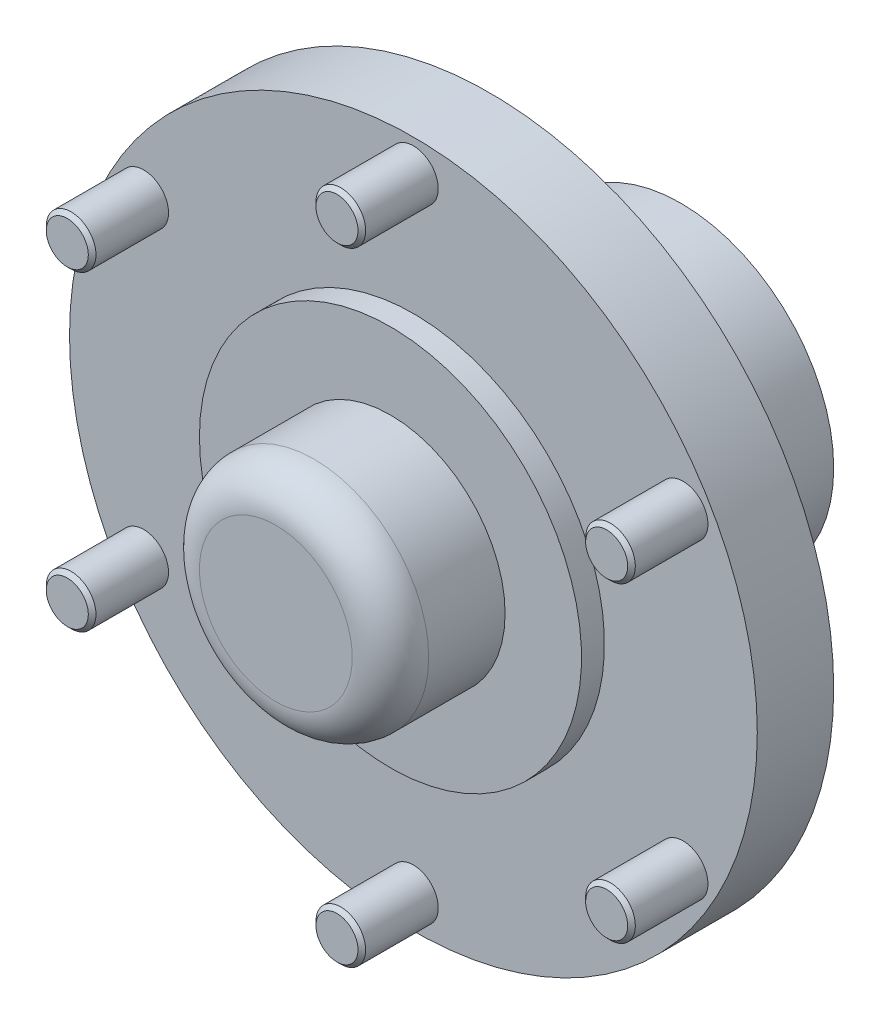
ISO-10303-21;
HEADER;
FILE_DESCRIPTION(('STEP AP214'),'2;1');
FILE_NAME('part.step','',(''),(''),'','','');
FILE_SCHEMA(('AUTOMOTIVE_DESIGN { 1 0 10303 214 1 1 1 1 }'));
ENDSEC;
DATA;
#1=APPLICATION_CONTEXT('core data for automotive mechanical design processes');
#2=APPLICATION_PROTOCOL_DEFINITION('international standard','automotive_design',2000,#1);
#3=PRODUCT_CONTEXT('',#1,'mechanical');
#4=PRODUCT('Part','Part','',(#3));
#5=PRODUCT_RELATED_PRODUCT_CATEGORY('part','',(#4));
#6=PRODUCT_DEFINITION_FORMATION('','',#4);
#7=PRODUCT_DEFINITION_CONTEXT('part definition',#1,'design');
#8=PRODUCT_DEFINITION('design','',#6,#7);
#9=PRODUCT_DEFINITION_SHAPE('','',#8);
#10=(LENGTH_UNIT() NAMED_UNIT(*) SI_UNIT(.MILLI.,.METRE.));
#11=(NAMED_UNIT(*) PLANE_ANGLE_UNIT() SI_UNIT($,.RADIAN.));
#12=(NAMED_UNIT(*) SI_UNIT($,.STERADIAN.) SOLID_ANGLE_UNIT());
#13=UNCERTAINTY_MEASURE_WITH_UNIT(LENGTH_MEASURE(1.E-05),#10,'distance_accuracy_value','');
#14=(GEOMETRIC_REPRESENTATION_CONTEXT(3) GLOBAL_UNCERTAINTY_ASSIGNED_CONTEXT((#13)) GLOBAL_UNIT_ASSIGNED_CONTEXT((#10,
#11,#12)) REPRESENTATION_CONTEXT('',''));
#15=CARTESIAN_POINT('',(0.,0.,0.));
#16=DIRECTION('',(0.,0.,1.));
#17=DIRECTION('',(1.,0.,0.));
#18=AXIS2_PLACEMENT_3D('',#15,#16,#17);
#19=CARTESIAN_POINT('',(90.0000000000001,1.86517468137026E-11,-36.0000000000014));
#20=DIRECTION('',(0.,0.,1.));
#21=DIRECTION('',(1.,0.,0.));
#22=AXIS2_PLACEMENT_3D('',#19,#20,#21);
#23=PLANE('',#22);
#24=CARTESIAN_POINT('',(70.5810704084321,40.7499999999993,-36.0000000000014));
#25=DIRECTION('',(0.,0.,1.));
#26=DIRECTION('',(0.,-1.,0.));
#27=AXIS2_PLACEMENT_3D('',#24,#25,#26);
#28=CIRCLE('',#27,6.5);
#29=CARTESIAN_POINT('',(70.5810704084321,34.2499999999993,-36.0000000000014));
#30=VERTEX_POINT('',#29);
#31=EDGE_CURVE('E126',#30,#30,#28,.T.);
#32=ORIENTED_EDGE('',*,*,#31,.F.);
#33=EDGE_LOOP('',(#32));
#34=FACE_BOUND('',#33,.T.);
#35=CARTESIAN_POINT('',(-70.5810704084316,40.7500000000003,-36.0000000000014));
#36=DIRECTION('',(0.,0.,1.));
#37=DIRECTION('',(0.,-1.,0.));
#38=AXIS2_PLACEMENT_3D('',#35,#36,#37);
#39=CIRCLE('',#38,6.5);
#40=CARTESIAN_POINT('',(-70.5810704084316,34.2500000000003,-36.0000000000014));
#41=VERTEX_POINT('',#40);
#42=EDGE_CURVE('E120',#41,#41,#39,.T.);
#43=ORIENTED_EDGE('',*,*,#42,.F.);
#44=EDGE_LOOP('',(#43));
#45=FACE_BOUND('',#44,.T.);
#46=CARTESIAN_POINT('',(-70.5810704084319,-40.7499999999998,-36.0000000000014));
#47=DIRECTION('',(0.,0.,1.));
#48=DIRECTION('',(0.,-1.,0.));
#49=AXIS2_PLACEMENT_3D('',#46,#47,#48);
#50=CIRCLE('',#49,6.5);
#51=CARTESIAN_POINT('',(-70.5810704084319,-47.2499999999999,-36.0000000000014));
#52=VERTEX_POINT('',#51);
#53=EDGE_CURVE('E114',#52,#52,#50,.T.);
#54=ORIENTED_EDGE('',*,*,#53,.F.);
#55=EDGE_LOOP('',(#54));
#56=FACE_BOUND('',#55,.T.);
#57=CARTESIAN_POINT('',(0.,1.86517468137026E-11,-36.0000000000014));
#58=DIRECTION('',(0.,0.,-1.));
#59=DIRECTION('',(-1.,0.,0.));
#60=AXIS2_PLACEMENT_3D('',#57,#58,#59);
#61=CIRCLE('',#60,50.);
#62=CARTESIAN_POINT('',(-50.,1.86517468137026E-11,-36.0000000000014));
#63=VERTEX_POINT('',#62);
#64=EDGE_CURVE('E105',#63,#63,#61,.T.);
#65=ORIENTED_EDGE('',*,*,#64,.T.);
#66=EDGE_LOOP('',(#65));
#67=FACE_BOUND('',#66,.T.);
#68=CARTESIAN_POINT('',(0.,1.86517468137026E-11,-36.0000000000014));
#69=DIRECTION('',(0.,0.,-1.));
#70=DIRECTION('',(-1.,0.,0.));
#71=AXIS2_PLACEMENT_3D('',#68,#69,#70);
#72=CIRCLE('',#71,90.0000000000001);
#73=CARTESIAN_POINT('',(-90.0000000000001,1.86517468137026E-11,-36.0000000000014));
#74=VERTEX_POINT('',#73);
#75=EDGE_CURVE('E102',#74,#74,#72,.T.);
#76=ORIENTED_EDGE('',*,*,#75,.F.);
#77=EDGE_LOOP('',(#76));
#78=FACE_BOUND('',#77,.T.);
#79=CARTESIAN_POINT('',(0.,-81.5,-36.0000000000014));
#80=DIRECTION('',(0.,0.,1.));
#81=DIRECTION('',(0.,-1.,0.));
#82=AXIS2_PLACEMENT_3D('',#79,#80,#81);
#83=CIRCLE('',#82,6.5);
#84=CARTESIAN_POINT('',(0.,-88.,-36.0000000000014));
#85=VERTEX_POINT('',#84);
#86=EDGE_CURVE('E117',#85,#85,#83,.T.);
#87=ORIENTED_EDGE('',*,*,#86,.F.);
#88=EDGE_LOOP('',(#87));
#89=FACE_BOUND('',#88,.T.);
#90=CARTESIAN_POINT('',(5.6770344404181E-13,81.5,-36.0000000000014));
#91=DIRECTION('',(0.,0.,1.));
#92=DIRECTION('',(0.,-1.,0.));
#93=AXIS2_PLACEMENT_3D('',#90,#91,#92);
#94=CIRCLE('',#93,6.5);
#95=CARTESIAN_POINT('',(5.6770344404181E-13,75.,-36.0000000000014));
#96=VERTEX_POINT('',#95);
#97=EDGE_CURVE('E123',#96,#96,#94,.T.);
#98=ORIENTED_EDGE('',*,*,#97,.F.);
#99=EDGE_LOOP('',(#98));
#100=FACE_BOUND('',#99,.T.);
#101=CARTESIAN_POINT('',(70.5810704084313,-40.7500000000008,-36.0000000000014));
#102=DIRECTION('',(0.,0.,1.));
#103=DIRECTION('',(0.,-1.,0.));
#104=AXIS2_PLACEMENT_3D('',#101,#102,#103);
#105=CIRCLE('',#104,6.5);
#106=CARTESIAN_POINT('',(70.5810704084313,-47.2500000000008,-36.0000000000014));
#107=VERTEX_POINT('',#106);
#108=EDGE_CURVE('E129',#107,#107,#105,.T.);
#109=ORIENTED_EDGE('',*,*,#108,.F.);
#110=EDGE_LOOP('',(#109));
#111=FACE_BOUND('',#110,.T.);
#112=ADVANCED_FACE('F34',(#34,#45,#56,#67,#78,#89,#100,#111),#23,.T.);
#113=CARTESIAN_POINT('',(0.,1.86517468137026E-11,0.));
#114=DIRECTION('',(0.,0.,-1.));
#115=DIRECTION('',(-1.,0.,0.));
#116=AXIS2_PLACEMENT_3D('',#113,#114,#115);
#117=CYLINDRICAL_SURFACE('',#116,30.);
#118=CARTESIAN_POINT('',(0.,1.86517468137026E-11,-10.));
#119=DIRECTION('',(0.,0.,1.));
#120=DIRECTION('',(1.,0.,0.));
#121=AXIS2_PLACEMENT_3D('',#118,#119,#120);
#122=CIRCLE('',#121,30.);
#123=CARTESIAN_POINT('',(30.,1.86517468137026E-11,-10.));
#124=VERTEX_POINT('',#123);
#125=EDGE_CURVE('E87',#124,#124,#122,.F.);
#126=ORIENTED_EDGE('',*,*,#125,.T.);
#127=EDGE_LOOP('',(#126));
#128=FACE_BOUND('',#127,.T.);
#129=CARTESIAN_POINT('',(0.,1.86517468137026E-11,-29.9999999999727));
#130=DIRECTION('',(0.,0.,-1.));
#131=DIRECTION('',(-1.,0.,0.));
#132=AXIS2_PLACEMENT_3D('',#129,#130,#131);
#133=CIRCLE('',#132,30.);
#134=CARTESIAN_POINT('',(-30.,1.86517468137026E-11,-29.9999999999727));
#135=VERTEX_POINT('',#134);
#136=EDGE_CURVE('E111',#135,#135,#133,.T.);
#137=ORIENTED_EDGE('',*,*,#136,.F.);
#138=EDGE_LOOP('',(#137));
#139=FACE_BOUND('',#138,.T.);
#140=ADVANCED_FACE('F136',(#128,#139),#117,.T.);
#141=CARTESIAN_POINT('',(30.,1.86517468137026E-11,0.));
#142=DIRECTION('',(0.,0.,1.));
#143=DIRECTION('',(1.,0.,0.));
#144=AXIS2_PLACEMENT_3D('',#141,#142,#143);
#145=PLANE('',#144);
#146=CARTESIAN_POINT('',(0.,1.86517468137026E-11,0.));
#147=DIRECTION('',(0.,0.,1.));
#148=DIRECTION('',(1.,0.,0.));
#149=AXIS2_PLACEMENT_3D('',#146,#147,#148);
#150=CIRCLE('',#149,20.);
#151=CARTESIAN_POINT('',(20.,1.86517468137026E-11,0.));
#152=VERTEX_POINT('',#151);
#153=EDGE_CURVE('E84',#152,#152,#150,.T.);
#154=ORIENTED_EDGE('',*,*,#153,.T.);
#155=EDGE_LOOP('',(#154));
#156=FACE_BOUND('',#155,.T.);
#157=ADVANCED_FACE('F142',(#156),#145,.T.);
#158=CARTESIAN_POINT('',(0.,1.86517468137026E-11,-76.0000000000218));
#159=DIRECTION('',(0.,0.,-1.));
#160=DIRECTION('',(-1.,0.,0.));
#161=AXIS2_PLACEMENT_3D('',#158,#159,#160);
#162=PLANE('',#161);
#163=CARTESIAN_POINT('',(0.,1.86517468137026E-11,-76.0000000000218));
#164=DIRECTION('',(0.,0.,-1.));
#165=DIRECTION('',(-1.,0.,0.));
#166=AXIS2_PLACEMENT_3D('',#163,#164,#165);
#167=CIRCLE('',#166,30.);
#168=CARTESIAN_POINT('',(-30.,1.86517468137026E-11,-76.0000000000218));
#169=VERTEX_POINT('',#168);
#170=EDGE_CURVE('E90',#169,#169,#167,.T.);
#171=ORIENTED_EDGE('',*,*,#170,.T.);
#172=EDGE_LOOP('',(#171));
#173=FACE_BOUND('',#172,.T.);
#174=ADVANCED_FACE('F170',(#173),#162,.T.);
#175=CARTESIAN_POINT('',(0.,1.86517468137026E-11,0.));
#176=DIRECTION('',(0.,0.,-1.));
#177=DIRECTION('',(-1.,0.,0.));
#178=AXIS2_PLACEMENT_3D('',#175,#176,#177);
#179=CYLINDRICAL_SURFACE('',#178,30.);
#180=CARTESIAN_POINT('',(0.,1.86517468137026E-11,-105.999999999995));
#181=DIRECTION('',(0.,0.,-1.));
#182=DIRECTION('',(-1.,0.,0.));
#183=AXIS2_PLACEMENT_3D('',#180,#181,#182);
#184=CIRCLE('',#183,30.);
#185=CARTESIAN_POINT('',(-30.,1.86517468137026E-11,-105.999999999995));
#186=VERTEX_POINT('',#185);
#187=EDGE_CURVE('E93',#186,#186,#184,.T.);
#188=ORIENTED_EDGE('',*,*,#187,.T.);
#189=EDGE_LOOP('',(#188));
#190=FACE_BOUND('',#189,.T.);
#191=ORIENTED_EDGE('',*,*,#170,.F.);
#192=EDGE_LOOP('',(#191));
#193=FACE_BOUND('',#192,.T.);
#194=ADVANCED_FACE('F166',(#190,#193),#179,.F.);
#195=CARTESIAN_POINT('',(30.,1.86517468137026E-11,-105.999999999995));
#196=DIRECTION('',(0.,0.,-1.));
#197=DIRECTION('',(-1.,0.,0.));
#198=AXIS2_PLACEMENT_3D('',#195,#196,#197);
#199=PLANE('',#198);
#200=CARTESIAN_POINT('',(0.,1.86517468137026E-11,-105.999999999995));
#201=DIRECTION('',(0.,0.,-1.));
#202=DIRECTION('',(-1.,0.,0.));
#203=AXIS2_PLACEMENT_3D('',#200,#201,#202);
#204=CIRCLE('',#203,40.);
#205=CARTESIAN_POINT('',(-40.,1.86517468137026E-11,-105.999999999995));
#206=VERTEX_POINT('',#205);
#207=EDGE_CURVE('E96',#206,#206,#204,.T.);
#208=ORIENTED_EDGE('',*,*,#207,.T.);
#209=EDGE_LOOP('',(#208));
#210=FACE_BOUND('',#209,.T.);
#211=ORIENTED_EDGE('',*,*,#187,.F.);
#212=EDGE_LOOP('',(#211));
#213=FACE_BOUND('',#212,.T.);
#214=ADVANCED_FACE('F162',(#210,#213),#199,.T.);
#215=CARTESIAN_POINT('',(0.,1.86517468137026E-11,0.));
#216=DIRECTION('',(0.,0.,-1.));
#217=DIRECTION('',(-1.,0.,0.));
#218=AXIS2_PLACEMENT_3D('',#215,#216,#217);
#219=CYLINDRICAL_SURFACE('',#218,40.);
#220=CARTESIAN_POINT('',(0.,1.86517468137026E-11,-80.9999999999832));
#221=DIRECTION('',(0.,0.,-1.));
#222=DIRECTION('',(-1.,0.,0.));
#223=AXIS2_PLACEMENT_3D('',#220,#221,#222);
#224=CIRCLE('',#223,40.);
#225=CARTESIAN_POINT('',(-40.,1.86517468137026E-11,-80.9999999999832));
#226=VERTEX_POINT('',#225);
#227=EDGE_CURVE('E81',#226,#226,#224,.T.);
#228=ORIENTED_EDGE('',*,*,#227,.T.);
#229=EDGE_LOOP('',(#228));
#230=FACE_BOUND('',#229,.T.);
#231=ORIENTED_EDGE('',*,*,#207,.F.);
#232=EDGE_LOOP('',(#231));
#233=FACE_BOUND('',#232,.T.);
#234=ADVANCED_FACE('F158',(#230,#233),#219,.T.);
#235=CARTESIAN_POINT('',(40.,1.86517468137026E-11,-55.9999999999832));
#236=DIRECTION('',(0.,0.,-1.));
#237=DIRECTION('',(-1.,0.,0.));
#238=AXIS2_PLACEMENT_3D('',#235,#236,#237);
#239=PLANE('',#238);
#240=CARTESIAN_POINT('',(0.,1.86517468137026E-11,-55.9999999999832));
#241=DIRECTION('',(0.,0.,-1.));
#242=DIRECTION('',(-1.,0.,0.));
#243=AXIS2_PLACEMENT_3D('',#240,#241,#242);
#244=CIRCLE('',#243,65.);
#245=CARTESIAN_POINT('',(-65.,1.86517468137026E-11,-55.9999999999832));
#246=VERTEX_POINT('',#245);
#247=EDGE_CURVE('E78',#246,#246,#244,.F.);
#248=ORIENTED_EDGE('',*,*,#247,.T.);
#249=EDGE_LOOP('',(#248));
#250=FACE_BOUND('',#249,.T.);
#251=CARTESIAN_POINT('',(0.,1.86517468137026E-11,-55.9999999999832));
#252=DIRECTION('',(0.,0.,-1.));
#253=DIRECTION('',(-1.,0.,0.));
#254=AXIS2_PLACEMENT_3D('',#251,#252,#253);
#255=CIRCLE('',#254,90.0000000000001);
#256=CARTESIAN_POINT('',(-90.0000000000001,1.86517468137026E-11,-55.9999999999832));
#257=VERTEX_POINT('',#256);
#258=EDGE_CURVE('E99',#257,#257,#255,.T.);
#259=ORIENTED_EDGE('',*,*,#258,.T.);
#260=EDGE_LOOP('',(#259));
#261=FACE_BOUND('',#260,.T.);
#262=ADVANCED_FACE('F154',(#250,#261),#239,.T.);
#263=CARTESIAN_POINT('',(0.,1.86517468137026E-11,0.));
#264=DIRECTION('',(0.,0.,-1.));
#265=DIRECTION('',(-1.,0.,0.));
#266=AXIS2_PLACEMENT_3D('',#263,#264,#265);
#267=CYLINDRICAL_SURFACE('',#266,90.0000000000001);
#268=ORIENTED_EDGE('',*,*,#75,.T.);
#269=EDGE_LOOP('',(#268));
#270=FACE_BOUND('',#269,.T.);
#271=ORIENTED_EDGE('',*,*,#258,.F.);
#272=EDGE_LOOP('',(#271));
#273=FACE_BOUND('',#272,.T.);
#274=ADVANCED_FACE('F151',(#270,#273),#267,.T.);
#275=CARTESIAN_POINT('',(0.,1.86517468137026E-11,0.));
#276=DIRECTION('',(0.,0.,-1.));
#277=DIRECTION('',(-1.,0.,0.));
#278=AXIS2_PLACEMENT_3D('',#275,#276,#277);
#279=CYLINDRICAL_SURFACE('',#278,50.);
#280=CARTESIAN_POINT('',(0.,1.86517468137026E-11,-29.9999999999727));
#281=DIRECTION('',(0.,0.,-1.));
#282=DIRECTION('',(-1.,0.,0.));
#283=AXIS2_PLACEMENT_3D('',#280,#281,#282);
#284=CIRCLE('',#283,50.);
#285=CARTESIAN_POINT('',(-50.,1.86517468137026E-11,-29.9999999999727));
#286=VERTEX_POINT('',#285);
#287=EDGE_CURVE('E108',#286,#286,#284,.T.);
#288=ORIENTED_EDGE('',*,*,#287,.T.);
#289=EDGE_LOOP('',(#288));
#290=FACE_BOUND('',#289,.T.);
#291=ORIENTED_EDGE('',*,*,#64,.F.);
#292=EDGE_LOOP('',(#291));
#293=FACE_BOUND('',#292,.T.);
#294=ADVANCED_FACE('F149',(#290,#293),#279,.T.);
#295=CARTESIAN_POINT('',(50.,1.86517468137026E-11,-29.9999999999727));
#296=DIRECTION('',(0.,0.,1.));
#297=DIRECTION('',(1.,0.,0.));
#298=AXIS2_PLACEMENT_3D('',#295,#296,#297);
#299=PLANE('',#298);
#300=ORIENTED_EDGE('',*,*,#136,.T.);
#301=EDGE_LOOP('',(#300));
#302=FACE_BOUND('',#301,.T.);
#303=ORIENTED_EDGE('',*,*,#287,.F.);
#304=EDGE_LOOP('',(#303));
#305=FACE_BOUND('',#304,.T.);
#306=ADVANCED_FACE('F242',(#302,#305),#299,.T.);
#307=CARTESIAN_POINT('',(-70.5810704084319,-40.7499999999998,-16.0000000000014));
#308=DIRECTION('',(0.,0.,-1.));
#309=DIRECTION('',(0.,1.,0.));
#310=AXIS2_PLACEMENT_3D('',#307,#308,#309);
#311=CYLINDRICAL_SURFACE('',#310,6.5);
#312=CARTESIAN_POINT('',(-70.5810704084319,-40.7499999999998,-17.0000000000014));
#313=DIRECTION('',(0.,0.,1.));
#314=DIRECTION('',(1.,0.,0.));
#315=AXIS2_PLACEMENT_3D('',#312,#313,#314);
#316=CIRCLE('',#315,6.5);
#317=CARTESIAN_POINT('',(-64.0810704084318,-40.7499999999998,-17.0000000000014));
#318=VERTEX_POINT('',#317);
#319=EDGE_CURVE('E11',#318,#318,#316,.F.);
#320=ORIENTED_EDGE('',*,*,#319,.T.);
#321=EDGE_LOOP('',(#320));
#322=FACE_BOUND('',#321,.T.);
#323=ORIENTED_EDGE('',*,*,#53,.T.);
#324=EDGE_LOOP('',(#323));
#325=FACE_BOUND('',#324,.T.);
#326=ADVANCED_FACE('F240',(#322,#325),#311,.T.);
#327=CARTESIAN_POINT('',(-70.5810704084319,-40.7499999999998,-16.0000000000014));
#328=DIRECTION('',(0.,0.,1.));
#329=DIRECTION('',(0.,-1.,0.));
#330=AXIS2_PLACEMENT_3D('',#327,#328,#329);
#331=PLANE('',#330);
#332=CARTESIAN_POINT('',(-70.5810704084319,-40.7499999999998,-16.0000000000014));
#333=DIRECTION('',(0.,0.,1.));
#334=DIRECTION('',(0.,-1.,0.));
#335=AXIS2_PLACEMENT_3D('',#332,#333,#334);
#336=CIRCLE('',#335,5.49999999999998);
#337=CARTESIAN_POINT('',(-70.5810704084319,-46.2499999999998,-16.0000000000014));
#338=VERTEX_POINT('',#337);
#339=EDGE_CURVE('E41',#338,#338,#336,.T.);
#340=ORIENTED_EDGE('',*,*,#339,.T.);
#341=EDGE_LOOP('',(#340));
#342=FACE_BOUND('',#341,.T.);
#343=ADVANCED_FACE('F236',(#342),#331,.T.);
#344=CARTESIAN_POINT('',(0.,-81.5,-16.0000000000014));
#345=DIRECTION('',(0.,0.,-1.));
#346=DIRECTION('',(0.,1.,0.));
#347=AXIS2_PLACEMENT_3D('',#344,#345,#346);
#348=CYLINDRICAL_SURFACE('',#347,6.5);
#349=CARTESIAN_POINT('',(0.,-81.5,-17.0000000000014));
#350=DIRECTION('',(0.,0.,1.));
#351=DIRECTION('',(1.,0.,0.));
#352=AXIS2_PLACEMENT_3D('',#349,#350,#351);
#353=CIRCLE('',#352,6.5);
#354=CARTESIAN_POINT('',(6.5,-81.5,-17.0000000000014));
#355=VERTEX_POINT('',#354);
#356=EDGE_CURVE('E60',#355,#355,#353,.F.);
#357=ORIENTED_EDGE('',*,*,#356,.T.);
#358=EDGE_LOOP('',(#357));
#359=FACE_BOUND('',#358,.T.);
#360=ORIENTED_EDGE('',*,*,#86,.T.);
#361=EDGE_LOOP('',(#360));
#362=FACE_BOUND('',#361,.T.);
#363=ADVANCED_FACE('F232',(#359,#362),#348,.T.);
#364=CARTESIAN_POINT('',(0.,-81.5,-16.0000000000014));
#365=DIRECTION('',(0.,0.,1.));
#366=DIRECTION('',(0.,-1.,0.));
#367=AXIS2_PLACEMENT_3D('',#364,#365,#366);
#368=PLANE('',#367);
#369=CARTESIAN_POINT('',(0.,-81.5,-16.0000000000014));
#370=DIRECTION('',(0.,0.,1.));
#371=DIRECTION('',(0.,-1.,0.));
#372=AXIS2_PLACEMENT_3D('',#369,#370,#371);
#373=CIRCLE('',#372,5.50000000000001);
#374=CARTESIAN_POINT('',(0.,-87.,-16.0000000000014));
#375=VERTEX_POINT('',#374);
#376=EDGE_CURVE('E63',#375,#375,#373,.T.);
#377=ORIENTED_EDGE('',*,*,#376,.T.);
#378=EDGE_LOOP('',(#377));
#379=FACE_BOUND('',#378,.T.);
#380=ADVANCED_FACE('F225',(#379),#368,.T.);
#381=CARTESIAN_POINT('',(-70.5810704084316,40.7500000000003,-16.0000000000014));
#382=DIRECTION('',(0.,0.,-1.));
#383=DIRECTION('',(0.,1.,0.));
#384=AXIS2_PLACEMENT_3D('',#381,#382,#383);
#385=CYLINDRICAL_SURFACE('',#384,6.5);
#386=CARTESIAN_POINT('',(-70.5810704084316,40.7500000000003,-17.0000000000013));
#387=DIRECTION('',(0.,0.,1.));
#388=DIRECTION('',(1.,0.,0.));
#389=AXIS2_PLACEMENT_3D('',#386,#387,#388);
#390=CIRCLE('',#389,6.5);
#391=CARTESIAN_POINT('',(-64.0810704084316,40.7500000000003,-17.0000000000013));
#392=VERTEX_POINT('',#391);
#393=EDGE_CURVE('E45',#392,#392,#390,.F.);
#394=ORIENTED_EDGE('',*,*,#393,.T.);
#395=EDGE_LOOP('',(#394));
#396=FACE_BOUND('',#395,.T.);
#397=ORIENTED_EDGE('',*,*,#42,.T.);
#398=EDGE_LOOP('',(#397));
#399=FACE_BOUND('',#398,.T.);
#400=ADVANCED_FACE('F216',(#396,#399),#385,.T.);
#401=CARTESIAN_POINT('',(-70.5810704084316,40.7500000000003,-16.0000000000014));
#402=DIRECTION('',(0.,0.,1.));
#403=DIRECTION('',(0.,-1.,0.));
#404=AXIS2_PLACEMENT_3D('',#401,#402,#403);
#405=PLANE('',#404);
#406=CARTESIAN_POINT('',(-70.5810704084316,40.7500000000003,-16.0000000000014));
#407=DIRECTION('',(0.,0.,1.));
#408=DIRECTION('',(0.,-1.,0.));
#409=AXIS2_PLACEMENT_3D('',#406,#407,#408);
#410=CIRCLE('',#409,5.5);
#411=CARTESIAN_POINT('',(-70.5810704084316,35.2500000000003,-16.0000000000014));
#412=VERTEX_POINT('',#411);
#413=EDGE_CURVE('E49',#412,#412,#410,.T.);
#414=ORIENTED_EDGE('',*,*,#413,.T.);
#415=EDGE_LOOP('',(#414));
#416=FACE_BOUND('',#415,.T.);
#417=ADVANCED_FACE('F213',(#416),#405,.T.);
#418=CARTESIAN_POINT('',(5.6770344404181E-13,81.5,-16.0000000000014));
#419=DIRECTION('',(0.,0.,-1.));
#420=DIRECTION('',(0.,1.,0.));
#421=AXIS2_PLACEMENT_3D('',#418,#419,#420);
#422=CYLINDRICAL_SURFACE('',#421,6.5);
#423=CARTESIAN_POINT('',(5.6770344404181E-13,81.5,-17.0000000000013));
#424=DIRECTION('',(0.,0.,1.));
#425=DIRECTION('',(1.,0.,0.));
#426=AXIS2_PLACEMENT_3D('',#423,#424,#425);
#427=CIRCLE('',#426,6.5);
#428=CARTESIAN_POINT('',(6.50000000000057,81.5,-17.0000000000013));
#429=VERTEX_POINT('',#428);
#430=EDGE_CURVE('E54',#429,#429,#427,.F.);
#431=ORIENTED_EDGE('',*,*,#430,.T.);
#432=EDGE_LOOP('',(#431));
#433=FACE_BOUND('',#432,.T.);
#434=ORIENTED_EDGE('',*,*,#97,.T.);
#435=EDGE_LOOP('',(#434));
#436=FACE_BOUND('',#435,.T.);
#437=ADVANCED_FACE('F215',(#433,#436),#422,.T.);
#438=CARTESIAN_POINT('',(5.6770344404181E-13,81.5,-16.0000000000014));
#439=DIRECTION('',(0.,0.,1.));
#440=DIRECTION('',(0.,-1.,0.));
#441=AXIS2_PLACEMENT_3D('',#438,#439,#440);
#442=PLANE('',#441);
#443=CARTESIAN_POINT('',(5.6770344404181E-13,81.5,-16.0000000000014));
#444=DIRECTION('',(0.,0.,1.));
#445=DIRECTION('',(0.,-1.,0.));
#446=AXIS2_PLACEMENT_3D('',#443,#444,#445);
#447=CIRCLE('',#446,5.50000000000001);
#448=CARTESIAN_POINT('',(5.6770344404181E-13,76.,-16.0000000000014));
#449=VERTEX_POINT('',#448);
#450=EDGE_CURVE('E57',#449,#449,#447,.T.);
#451=ORIENTED_EDGE('',*,*,#450,.T.);
#452=EDGE_LOOP('',(#451));
#453=FACE_BOUND('',#452,.T.);
#454=ADVANCED_FACE('F222',(#453),#442,.T.);
#455=CARTESIAN_POINT('',(70.5810704084321,40.7499999999993,-16.0000000000014));
#456=DIRECTION('',(0.,0.,-1.));
#457=DIRECTION('',(0.,1.,0.));
#458=AXIS2_PLACEMENT_3D('',#455,#456,#457);
#459=CYLINDRICAL_SURFACE('',#458,6.5);
#460=CARTESIAN_POINT('',(70.5810704084321,40.7499999999993,-17.0000000000014));
#461=DIRECTION('',(0.,0.,1.));
#462=DIRECTION('',(1.,0.,0.));
#463=AXIS2_PLACEMENT_3D('',#460,#461,#462);
#464=CIRCLE('',#463,6.5);
#465=CARTESIAN_POINT('',(77.0810704084321,40.7499999999993,-17.0000000000014));
#466=VERTEX_POINT('',#465);
#467=EDGE_CURVE('E72',#466,#466,#464,.F.);
#468=ORIENTED_EDGE('',*,*,#467,.T.);
#469=EDGE_LOOP('',(#468));
#470=FACE_BOUND('',#469,.T.);
#471=ORIENTED_EDGE('',*,*,#31,.T.);
#472=EDGE_LOOP('',(#471));
#473=FACE_BOUND('',#472,.T.);
#474=ADVANCED_FACE('F371',(#470,#473),#459,.T.);
#475=CARTESIAN_POINT('',(70.5810704084321,40.7499999999993,-16.0000000000014));
#476=DIRECTION('',(0.,0.,1.));
#477=DIRECTION('',(0.,-1.,0.));
#478=AXIS2_PLACEMENT_3D('',#475,#476,#477);
#479=PLANE('',#478);
#480=CARTESIAN_POINT('',(70.5810704084321,40.7499999999993,-16.0000000000014));
#481=DIRECTION('',(0.,0.,1.));
#482=DIRECTION('',(0.,-1.,0.));
#483=AXIS2_PLACEMENT_3D('',#480,#481,#482);
#484=CIRCLE('',#483,5.49999999999998);
#485=CARTESIAN_POINT('',(70.5810704084321,35.2499999999994,-16.0000000000014));
#486=VERTEX_POINT('',#485);
#487=EDGE_CURVE('E75',#486,#486,#484,.T.);
#488=ORIENTED_EDGE('',*,*,#487,.T.);
#489=EDGE_LOOP('',(#488));
#490=FACE_BOUND('',#489,.T.);
#491=ADVANCED_FACE('F379',(#490),#479,.T.);
#492=CARTESIAN_POINT('',(70.5810704084313,-40.7500000000008,-16.0000000000014));
#493=DIRECTION('',(0.,0.,-1.));
#494=DIRECTION('',(0.,1.,0.));
#495=AXIS2_PLACEMENT_3D('',#492,#493,#494);
#496=CYLINDRICAL_SURFACE('',#495,6.5);
#497=CARTESIAN_POINT('',(70.5810704084313,-40.7500000000008,-17.0000000000014));
#498=DIRECTION('',(0.,0.,1.));
#499=DIRECTION('',(1.,0.,0.));
#500=AXIS2_PLACEMENT_3D('',#497,#498,#499);
#501=CIRCLE('',#500,6.5);
#502=CARTESIAN_POINT('',(77.0810704084313,-40.7500000000008,-17.0000000000014));
#503=VERTEX_POINT('',#502);
#504=EDGE_CURVE('E66',#503,#503,#501,.F.);
#505=ORIENTED_EDGE('',*,*,#504,.T.);
#506=EDGE_LOOP('',(#505));
#507=FACE_BOUND('',#506,.T.);
#508=ORIENTED_EDGE('',*,*,#108,.T.);
#509=EDGE_LOOP('',(#508));
#510=FACE_BOUND('',#509,.T.);
#511=ADVANCED_FACE('F133',(#507,#510),#496,.T.);
#512=CARTESIAN_POINT('',(70.5810704084313,-40.7500000000008,-16.0000000000014));
#513=DIRECTION('',(0.,0.,1.));
#514=DIRECTION('',(0.,-1.,0.));
#515=AXIS2_PLACEMENT_3D('',#512,#513,#514);
#516=PLANE('',#515);
#517=CARTESIAN_POINT('',(70.5810704084313,-40.7500000000008,-16.0000000000014));
#518=DIRECTION('',(0.,0.,1.));
#519=DIRECTION('',(0.,-1.,0.));
#520=AXIS2_PLACEMENT_3D('',#517,#518,#519);
#521=CIRCLE('',#520,5.49999999999998);
#522=CARTESIAN_POINT('',(70.5810704084313,-46.2500000000008,-16.0000000000014));
#523=VERTEX_POINT('',#522);
#524=EDGE_CURVE('E69',#523,#523,#521,.T.);
#525=ORIENTED_EDGE('',*,*,#524,.T.);
#526=EDGE_LOOP('',(#525));
#527=FACE_BOUND('',#526,.T.);
#528=ADVANCED_FACE('F182',(#527),#516,.T.);
#529=CARTESIAN_POINT('',(0.,1.86517468137026E-11,-10.));
#530=DIRECTION('',(0.,0.,1.));
#531=DIRECTION('',(1.,0.,0.));
#532=AXIS2_PLACEMENT_3D('',#529,#530,#531);
#533=TOROIDAL_SURFACE('',#532,20.,10.);
#534=ORIENTED_EDGE('',*,*,#153,.F.);
#535=EDGE_LOOP('',(#534));
#536=FACE_BOUND('',#535,.T.);
#537=ORIENTED_EDGE('',*,*,#125,.F.);
#538=EDGE_LOOP('',(#537));
#539=FACE_BOUND('',#538,.T.);
#540=ADVANCED_FACE('F178',(#536,#539),#533,.T.);
#541=CARTESIAN_POINT('',(0.,1.86517468137026E-11,-80.9999999999832));
#542=DIRECTION('',(0.,0.,-1.));
#543=DIRECTION('',(-1.,0.,0.));
#544=AXIS2_PLACEMENT_3D('',#541,#542,#543);
#545=TOROIDAL_SURFACE('',#544,65.,25.);
#546=ORIENTED_EDGE('',*,*,#247,.F.);
#547=EDGE_LOOP('',(#546));
#548=FACE_BOUND('',#547,.T.);
#549=ORIENTED_EDGE('',*,*,#227,.F.);
#550=EDGE_LOOP('',(#549));
#551=FACE_BOUND('',#550,.T.);
#552=ADVANCED_FACE('F181',(#548,#551),#545,.F.);
#553=CARTESIAN_POINT('',(70.5810704084321,40.7499999999993,-16.0000000000014));
#554=DIRECTION('',(0.,0.,-1.));
#555=DIRECTION('',(-1.,0.,0.));
#556=AXIS2_PLACEMENT_3D('',#553,#554,#555);
#557=CONICAL_SURFACE('',#556,5.49999999999998,0.785398163397459);
#558=ORIENTED_EDGE('',*,*,#467,.F.);
#559=EDGE_LOOP('',(#558));
#560=FACE_BOUND('',#559,.T.);
#561=ORIENTED_EDGE('',*,*,#487,.F.);
#562=EDGE_LOOP('',(#561));
#563=FACE_BOUND('',#562,.T.);
#564=ADVANCED_FACE('F186',(#560,#563),#557,.T.);
#565=CARTESIAN_POINT('',(70.5810704084313,-40.7500000000008,-16.0000000000014));
#566=DIRECTION('',(0.,0.,-1.));
#567=DIRECTION('',(-1.,0.,0.));
#568=AXIS2_PLACEMENT_3D('',#565,#566,#567);
#569=CONICAL_SURFACE('',#568,5.49999999999998,0.785398163397459);
#570=ORIENTED_EDGE('',*,*,#504,.F.);
#571=EDGE_LOOP('',(#570));
#572=FACE_BOUND('',#571,.T.);
#573=ORIENTED_EDGE('',*,*,#524,.F.);
#574=EDGE_LOOP('',(#573));
#575=FACE_BOUND('',#574,.T.);
#576=ADVANCED_FACE('F190',(#572,#575),#569,.T.);
#577=CARTESIAN_POINT('',(0.,-81.5,-16.0000000000014));
#578=DIRECTION('',(0.,0.,-1.));
#579=DIRECTION('',(-1.,0.,0.));
#580=AXIS2_PLACEMENT_3D('',#577,#578,#579);
#581=CONICAL_SURFACE('',#580,5.50000000000001,0.78539816339746);
#582=ORIENTED_EDGE('',*,*,#356,.F.);
#583=EDGE_LOOP('',(#582));
#584=FACE_BOUND('',#583,.T.);
#585=ORIENTED_EDGE('',*,*,#376,.F.);
#586=EDGE_LOOP('',(#585));
#587=FACE_BOUND('',#586,.T.);
#588=ADVANCED_FACE('F194',(#584,#587),#581,.T.);
#589=CARTESIAN_POINT('',(5.6770344404181E-13,81.5,-16.0000000000014));
#590=DIRECTION('',(0.,0.,-1.));
#591=DIRECTION('',(-1.,0.,0.));
#592=AXIS2_PLACEMENT_3D('',#589,#590,#591);
#593=CONICAL_SURFACE('',#592,5.50000000000001,0.78539816339746);
#594=ORIENTED_EDGE('',*,*,#430,.F.);
#595=EDGE_LOOP('',(#594));
#596=FACE_BOUND('',#595,.T.);
#597=ORIENTED_EDGE('',*,*,#450,.F.);
#598=EDGE_LOOP('',(#597));
#599=FACE_BOUND('',#598,.T.);
#600=ADVANCED_FACE('F198',(#596,#599),#593,.T.);
#601=CARTESIAN_POINT('',(-70.5810704084316,40.7500000000003,-16.0000000000014));
#602=DIRECTION('',(0.,0.,-1.));
#603=DIRECTION('',(-1.,0.,0.));
#604=AXIS2_PLACEMENT_3D('',#601,#602,#603);
#605=CONICAL_SURFACE('',#604,5.5,0.785398163397463);
#606=ORIENTED_EDGE('',*,*,#393,.F.);
#607=EDGE_LOOP('',(#606));
#608=FACE_BOUND('',#607,.T.);
#609=ORIENTED_EDGE('',*,*,#413,.F.);
#610=EDGE_LOOP('',(#609));
#611=FACE_BOUND('',#610,.T.);
#612=ADVANCED_FACE('F201',(#608,#611),#605,.T.);
#613=CARTESIAN_POINT('',(-70.5810704084319,-40.7499999999998,-16.0000000000014));
#614=DIRECTION('',(0.,0.,-1.));
#615=DIRECTION('',(-1.,0.,0.));
#616=AXIS2_PLACEMENT_3D('',#613,#614,#615);
#617=CONICAL_SURFACE('',#616,5.49999999999998,0.785398163397459);
#618=ORIENTED_EDGE('',*,*,#319,.F.);
#619=EDGE_LOOP('',(#618));
#620=FACE_BOUND('',#619,.T.);
#621=ORIENTED_EDGE('',*,*,#339,.F.);
#622=EDGE_LOOP('',(#621));
#623=FACE_BOUND('',#622,.T.);
#624=ADVANCED_FACE('F36',(#620,#623),#617,.T.);
#625=CLOSED_SHELL('',(#112,#140,#157,#174,#194,#214,#234,#262,#274,#294,#306,#326,#343,#363,
#380,#400,#417,#437,#454,#474,#491,#511,#528,#540,#552,#564,#576,#588,#600,#612,#624));
#626=MANIFOLD_SOLID_BREP('B2',#625);
#627=ADVANCED_BREP_SHAPE_REPRESENTATION('',(#18,#626),#14);
#628=SHAPE_DEFINITION_REPRESENTATION(#9,#627);
ENDSEC;
END-ISO-10303-21;
